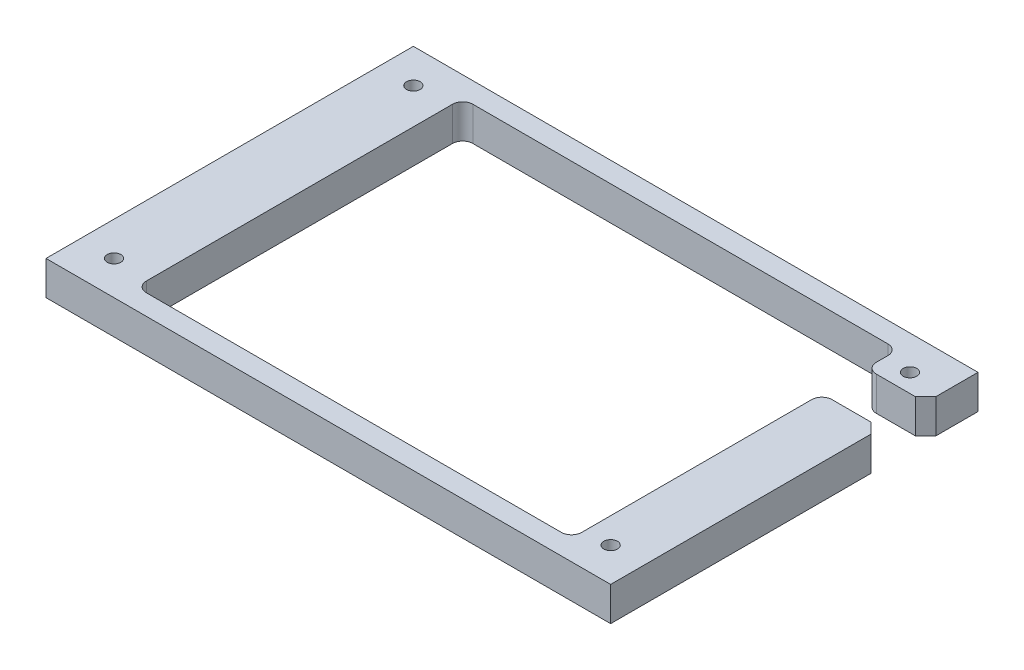
ISO-10303-21;
HEADER;
FILE_DESCRIPTION(('STEP AP214'),'2;1');
FILE_NAME('part.step','',(''),(''),'','','');
FILE_SCHEMA(('AUTOMOTIVE_DESIGN { 1 0 10303 214 1 1 1 1 }'));
ENDSEC;
DATA;
#1=APPLICATION_CONTEXT('core data for automotive mechanical design processes');
#2=APPLICATION_PROTOCOL_DEFINITION('international standard','automotive_design',2000,#1);
#3=PRODUCT_CONTEXT('',#1,'mechanical');
#4=PRODUCT('Part','Part','',(#3));
#5=PRODUCT_RELATED_PRODUCT_CATEGORY('part','',(#4));
#6=PRODUCT_DEFINITION_FORMATION('','',#4);
#7=PRODUCT_DEFINITION_CONTEXT('part definition',#1,'design');
#8=PRODUCT_DEFINITION('design','',#6,#7);
#9=PRODUCT_DEFINITION_SHAPE('','',#8);
#10=(LENGTH_UNIT() NAMED_UNIT(*) SI_UNIT(.MILLI.,.METRE.));
#11=(NAMED_UNIT(*) PLANE_ANGLE_UNIT() SI_UNIT($,.RADIAN.));
#12=(NAMED_UNIT(*) SI_UNIT($,.STERADIAN.) SOLID_ANGLE_UNIT());
#13=UNCERTAINTY_MEASURE_WITH_UNIT(LENGTH_MEASURE(1.E-05),#10,'distance_accuracy_value','');
#14=(GEOMETRIC_REPRESENTATION_CONTEXT(3) GLOBAL_UNCERTAINTY_ASSIGNED_CONTEXT((#13)) GLOBAL_UNIT_ASSIGNED_CONTEXT((#10,
#11,#12)) REPRESENTATION_CONTEXT('',''));
#15=CARTESIAN_POINT('',(0.,0.,0.));
#16=DIRECTION('',(0.,0.,1.));
#17=DIRECTION('',(1.,0.,0.));
#18=AXIS2_PLACEMENT_3D('',#15,#16,#17);
#19=CARTESIAN_POINT('',(83.,10.,54.));
#20=DIRECTION('',(-1.,0.,0.));
#21=DIRECTION('',(0.,0.,1.));
#22=AXIS2_PLACEMENT_3D('',#19,#20,#21);
#23=PLANE('',#22);
#24=DIRECTION('',(0.,0.,-1.));
#25=VECTOR('',#24,1.);
#26=CARTESIAN_POINT('',(83.,10.,54.));
#27=LINE('',#26,#25);
#28=CARTESIAN_POINT('',(83.,10.,-41.6));
#29=VERTEX_POINT('',#28);
#30=CARTESIAN_POINT('',(83.,10.,-54.));
#31=VERTEX_POINT('',#30);
#32=EDGE_CURVE('E170',#29,#31,#27,.T.);
#33=ORIENTED_EDGE('',*,*,#32,.F.);
#34=DIRECTION('',(0.,-1.,0.));
#35=VECTOR('',#34,1.);
#36=CARTESIAN_POINT('',(83.,10.,-41.6));
#37=LINE('',#36,#35);
#38=CARTESIAN_POINT('',(83.,0.,-41.6));
#39=VERTEX_POINT('',#38);
#40=EDGE_CURVE('E256',#29,#39,#37,.T.);
#41=ORIENTED_EDGE('',*,*,#40,.T.);
#42=DIRECTION('',(0.,0.,-1.));
#43=VECTOR('',#42,1.);
#44=CARTESIAN_POINT('',(83.,0.,54.));
#45=LINE('',#44,#43);
#46=CARTESIAN_POINT('',(83.,0.,-54.));
#47=VERTEX_POINT('',#46);
#48=EDGE_CURVE('E194',#39,#47,#45,.T.);
#49=ORIENTED_EDGE('',*,*,#48,.T.);
#50=DIRECTION('',(0.,-1.,0.));
#51=VECTOR('',#50,1.);
#52=CARTESIAN_POINT('',(83.,10.,-54.));
#53=LINE('',#52,#51);
#54=EDGE_CURVE('E187',#31,#47,#53,.T.);
#55=ORIENTED_EDGE('',*,*,#54,.F.);
#56=EDGE_LOOP('',(#33,#41,#49,#55));
#57=FACE_BOUND('',#56,.T.);
#58=ADVANCED_FACE('F34',(#57),#23,.F.);
#59=CARTESIAN_POINT('',(65.5,0.,48.));
#60=DIRECTION('',(1.,0.,0.));
#61=DIRECTION('',(0.,0.,-1.));
#62=AXIS2_PLACEMENT_3D('',#59,#60,#61);
#63=PLANE('',#62);
#64=DIRECTION('',(0.,0.,-1.));
#65=VECTOR('',#64,1.);
#66=CARTESIAN_POINT('',(65.5,0.,48.));
#67=LINE('',#66,#65);
#68=CARTESIAN_POINT('',(65.5,0.,-41.6));
#69=VERTEX_POINT('',#68);
#70=CARTESIAN_POINT('',(65.5,0.,-45.));
#71=VERTEX_POINT('',#70);
#72=EDGE_CURVE('E275',#69,#71,#67,.T.);
#73=ORIENTED_EDGE('',*,*,#72,.F.);
#74=DIRECTION('',(0.,1.,0.));
#75=VECTOR('',#74,1.);
#76=CARTESIAN_POINT('',(65.5,0.,-41.6));
#77=LINE('',#76,#75);
#78=CARTESIAN_POINT('',(65.5,10.,-41.6));
#79=VERTEX_POINT('',#78);
#80=EDGE_CURVE('E42',#69,#79,#77,.T.);
#81=ORIENTED_EDGE('',*,*,#80,.T.);
#82=DIRECTION('',(0.,0.,-1.));
#83=VECTOR('',#82,1.);
#84=CARTESIAN_POINT('',(65.5,10.,48.));
#85=LINE('',#84,#83);
#86=CARTESIAN_POINT('',(65.5,10.,-45.));
#87=VERTEX_POINT('',#86);
#88=EDGE_CURVE('E274',#79,#87,#85,.T.);
#89=ORIENTED_EDGE('',*,*,#88,.T.);
#90=DIRECTION('',(0.,1.,0.));
#91=VECTOR('',#90,1.);
#92=CARTESIAN_POINT('',(65.5,0.,-45.));
#93=LINE('',#92,#91);
#94=EDGE_CURVE('E206',#87,#71,#93,.F.);
#95=ORIENTED_EDGE('',*,*,#94,.T.);
#96=EDGE_LOOP('',(#73,#81,#89,#95));
#97=FACE_BOUND('',#96,.T.);
#98=ADVANCED_FACE('F273',(#97),#63,.F.);
#99=CARTESIAN_POINT('',(83.,0.,54.));
#100=VERTEX_POINT('',#99);
#101=CARTESIAN_POINT('',(83.,0.,-22.6));
#102=VERTEX_POINT('',#101);
#103=EDGE_CURVE('E327',#100,#102,#45,.T.);
#104=ORIENTED_EDGE('',*,*,#103,.T.);
#105=DIRECTION('',(0.,1.,0.));
#106=VECTOR('',#105,1.);
#107=CARTESIAN_POINT('',(83.,10.,-22.6));
#108=LINE('',#107,#106);
#109=CARTESIAN_POINT('',(83.,10.,-22.6));
#110=VERTEX_POINT('',#109);
#111=EDGE_CURVE('E239',#102,#110,#108,.T.);
#112=ORIENTED_EDGE('',*,*,#111,.T.);
#113=CARTESIAN_POINT('',(83.,10.,54.));
#114=VERTEX_POINT('',#113);
#115=EDGE_CURVE('E181',#114,#110,#27,.T.);
#116=ORIENTED_EDGE('',*,*,#115,.F.);
#117=DIRECTION('',(0.,-1.,0.));
#118=VECTOR('',#117,1.);
#119=CARTESIAN_POINT('',(83.,10.,54.));
#120=LINE('',#119,#118);
#121=EDGE_CURVE('E326',#114,#100,#120,.T.);
#122=ORIENTED_EDGE('',*,*,#121,.T.);
#123=EDGE_LOOP('',(#104,#112,#116,#122));
#124=FACE_BOUND('',#123,.T.);
#125=ADVANCED_FACE('F352',(#124),#23,.F.);
#126=CARTESIAN_POINT('',(-83.,10.,-54.));
#127=DIRECTION('',(0.,0.,1.));
#128=DIRECTION('',(1.,0.,0.));
#129=AXIS2_PLACEMENT_3D('',#126,#127,#128);
#130=PLANE('',#129);
#131=DIRECTION('',(-1.,0.,0.));
#132=VECTOR('',#131,1.);
#133=CARTESIAN_POINT('',(-83.,0.,-54.));
#134=LINE('',#133,#132);
#135=CARTESIAN_POINT('',(-83.,0.,-54.));
#136=VERTEX_POINT('',#135);
#137=EDGE_CURVE('E330',#47,#136,#134,.T.);
#138=ORIENTED_EDGE('',*,*,#137,.T.);
#139=DIRECTION('',(0.,-1.,0.));
#140=VECTOR('',#139,1.);
#141=CARTESIAN_POINT('',(-83.,10.,-54.));
#142=LINE('',#141,#140);
#143=CARTESIAN_POINT('',(-83.,10.,-54.));
#144=VERTEX_POINT('',#143);
#145=EDGE_CURVE('E189',#144,#136,#142,.T.);
#146=ORIENTED_EDGE('',*,*,#145,.F.);
#147=DIRECTION('',(-1.,0.,0.));
#148=VECTOR('',#147,1.);
#149=CARTESIAN_POINT('',(-83.,10.,-54.));
#150=LINE('',#149,#148);
#151=EDGE_CURVE('E174',#31,#144,#150,.T.);
#152=ORIENTED_EDGE('',*,*,#151,.F.);
#153=ORIENTED_EDGE('',*,*,#54,.T.);
#154=EDGE_LOOP('',(#138,#146,#152,#153));
#155=FACE_BOUND('',#154,.T.);
#156=ADVANCED_FACE('F186',(#155),#130,.F.);
#157=CARTESIAN_POINT('',(-83.,10.,54.));
#158=DIRECTION('',(1.,0.,0.));
#159=DIRECTION('',(0.,0.,-1.));
#160=AXIS2_PLACEMENT_3D('',#157,#158,#159);
#161=PLANE('',#160);
#162=DIRECTION('',(0.,0.,1.));
#163=VECTOR('',#162,1.);
#164=CARTESIAN_POINT('',(-83.,0.,54.));
#165=LINE('',#164,#163);
#166=CARTESIAN_POINT('',(-83.,0.,54.));
#167=VERTEX_POINT('',#166);
#168=EDGE_CURVE('E332',#136,#167,#165,.T.);
#169=ORIENTED_EDGE('',*,*,#168,.T.);
#170=DIRECTION('',(0.,-1.,0.));
#171=VECTOR('',#170,1.);
#172=CARTESIAN_POINT('',(-83.,10.,54.));
#173=LINE('',#172,#171);
#174=CARTESIAN_POINT('',(-83.,10.,54.));
#175=VERTEX_POINT('',#174);
#176=EDGE_CURVE('E200',#175,#167,#173,.T.);
#177=ORIENTED_EDGE('',*,*,#176,.F.);
#178=DIRECTION('',(0.,0.,1.));
#179=VECTOR('',#178,1.);
#180=CARTESIAN_POINT('',(-83.,10.,54.));
#181=LINE('',#180,#179);
#182=EDGE_CURVE('E191',#144,#175,#181,.T.);
#183=ORIENTED_EDGE('',*,*,#182,.F.);
#184=ORIENTED_EDGE('',*,*,#145,.T.);
#185=EDGE_LOOP('',(#169,#177,#183,#184));
#186=FACE_BOUND('',#185,.T.);
#187=ADVANCED_FACE('F358',(#186),#161,.F.);
#188=CARTESIAN_POINT('',(-83.,10.,54.));
#189=DIRECTION('',(0.,0.,-1.));
#190=DIRECTION('',(-1.,0.,0.));
#191=AXIS2_PLACEMENT_3D('',#188,#189,#190);
#192=PLANE('',#191);
#193=DIRECTION('',(1.,0.,0.));
#194=VECTOR('',#193,1.);
#195=CARTESIAN_POINT('',(-83.,0.,54.));
#196=LINE('',#195,#194);
#197=EDGE_CURVE('E182',#167,#100,#196,.T.);
#198=ORIENTED_EDGE('',*,*,#197,.T.);
#199=ORIENTED_EDGE('',*,*,#121,.F.);
#200=DIRECTION('',(1.,0.,0.));
#201=VECTOR('',#200,1.);
#202=CARTESIAN_POINT('',(-83.,10.,54.));
#203=LINE('',#202,#201);
#204=EDGE_CURVE('E324',#175,#114,#203,.T.);
#205=ORIENTED_EDGE('',*,*,#204,.F.);
#206=ORIENTED_EDGE('',*,*,#176,.T.);
#207=EDGE_LOOP('',(#198,#199,#205,#206));
#208=FACE_BOUND('',#207,.T.);
#209=ADVANCED_FACE('F341',(#208),#192,.F.);
#210=CARTESIAN_POINT('',(0.,10.,0.));
#211=DIRECTION('',(0.,-1.,0.));
#212=DIRECTION('',(0.,0.,-1.));
#213=AXIS2_PLACEMENT_3D('',#210,#211,#212);
#214=PLANE('',#213);
#215=CARTESIAN_POINT('',(73.,10.,44.));
#216=DIRECTION('',(0.,1.,0.));
#217=DIRECTION('',(0.,0.,1.));
#218=AXIS2_PLACEMENT_3D('',#215,#216,#217);
#219=CIRCLE('',#218,2.);
#220=CARTESIAN_POINT('',(73.,10.,46.));
#221=VERTEX_POINT('',#220);
#222=EDGE_CURVE('E302',#221,#221,#219,.T.);
#223=ORIENTED_EDGE('',*,*,#222,.F.);
#224=EDGE_LOOP('',(#223));
#225=FACE_BOUND('',#224,.T.);
#226=CARTESIAN_POINT('',(-73.,10.,44.));
#227=DIRECTION('',(0.,1.,0.));
#228=DIRECTION('',(0.,0.,1.));
#229=AXIS2_PLACEMENT_3D('',#226,#227,#228);
#230=CIRCLE('',#229,2.);
#231=CARTESIAN_POINT('',(-73.,10.,46.));
#232=VERTEX_POINT('',#231);
#233=EDGE_CURVE('E301',#232,#232,#230,.T.);
#234=ORIENTED_EDGE('',*,*,#233,.F.);
#235=EDGE_LOOP('',(#234));
#236=FACE_BOUND('',#235,.T.);
#237=CARTESIAN_POINT('',(73.,10.,-44.));
#238=DIRECTION('',(0.,1.,0.));
#239=DIRECTION('',(0.,0.,1.));
#240=AXIS2_PLACEMENT_3D('',#237,#238,#239);
#241=CIRCLE('',#240,2.);
#242=CARTESIAN_POINT('',(73.,10.,-42.));
#243=VERTEX_POINT('',#242);
#244=EDGE_CURVE('E308',#243,#243,#241,.T.);
#245=ORIENTED_EDGE('',*,*,#244,.F.);
#246=EDGE_LOOP('',(#245));
#247=FACE_BOUND('',#246,.T.);
#248=CARTESIAN_POINT('',(-73.,10.,-44.));
#249=DIRECTION('',(0.,1.,0.));
#250=DIRECTION('',(0.,0.,1.));
#251=AXIS2_PLACEMENT_3D('',#248,#249,#250);
#252=CIRCLE('',#251,2.);
#253=CARTESIAN_POINT('',(-73.,10.,-42.));
#254=VERTEX_POINT('',#253);
#255=EDGE_CURVE('E314',#254,#254,#252,.T.);
#256=ORIENTED_EDGE('',*,*,#255,.F.);
#257=EDGE_LOOP('',(#256));
#258=FACE_BOUND('',#257,.T.);
#259=DIRECTION('',(1.,0.,0.));
#260=VECTOR('',#259,1.);
#261=CARTESIAN_POINT('',(65.5,10.,-25.6));
#262=LINE('',#261,#260);
#263=CARTESIAN_POINT('',(68.5,10.,-25.6));
#264=VERTEX_POINT('',#263);
#265=CARTESIAN_POINT('',(80.,10.,-25.6));
#266=VERTEX_POINT('',#265);
#267=EDGE_CURVE('E357',#264,#266,#262,.T.);
#268=ORIENTED_EDGE('',*,*,#267,.F.);
#269=CARTESIAN_POINT('',(68.5,10.,-22.6));
#270=DIRECTION('',(0.,-1.,0.));
#271=DIRECTION('',(0.,0.,-1.));
#272=AXIS2_PLACEMENT_3D('',#269,#270,#271);
#273=CIRCLE('',#272,3.);
#274=CARTESIAN_POINT('',(65.5,10.,-22.6));
#275=VERTEX_POINT('',#274);
#276=EDGE_CURVE('E263',#264,#275,#273,.F.);
#277=ORIENTED_EDGE('',*,*,#276,.T.);
#278=CARTESIAN_POINT('',(65.5,10.,45.));
#279=VERTEX_POINT('',#278);
#280=EDGE_CURVE('E279',#279,#275,#85,.T.);
#281=ORIENTED_EDGE('',*,*,#280,.F.);
#282=CARTESIAN_POINT('',(62.5,10.,45.));
#283=DIRECTION('',(0.,-1.,0.));
#284=DIRECTION('',(0.,0.,-1.));
#285=AXIS2_PLACEMENT_3D('',#282,#283,#284);
#286=CIRCLE('',#285,3.);
#287=CARTESIAN_POINT('',(62.5,10.,48.));
#288=VERTEX_POINT('',#287);
#289=EDGE_CURVE('E227',#279,#288,#286,.T.);
#290=ORIENTED_EDGE('',*,*,#289,.T.);
#291=DIRECTION('',(1.,0.,0.));
#292=VECTOR('',#291,1.);
#293=CARTESIAN_POINT('',(-62.5,10.,48.));
#294=LINE('',#293,#292);
#295=CARTESIAN_POINT('',(-59.5,10.,48.));
#296=VERTEX_POINT('',#295);
#297=EDGE_CURVE('E295',#296,#288,#294,.T.);
#298=ORIENTED_EDGE('',*,*,#297,.F.);
#299=CARTESIAN_POINT('',(-59.5,10.,45.));
#300=DIRECTION('',(0.,-1.,0.));
#301=DIRECTION('',(0.,0.,-1.));
#302=AXIS2_PLACEMENT_3D('',#299,#300,#301);
#303=CIRCLE('',#302,3.);
#304=CARTESIAN_POINT('',(-62.5,10.,45.));
#305=VERTEX_POINT('',#304);
#306=EDGE_CURVE('E231',#296,#305,#303,.T.);
#307=ORIENTED_EDGE('',*,*,#306,.T.);
#308=DIRECTION('',(0.,0.,1.));
#309=VECTOR('',#308,1.);
#310=CARTESIAN_POINT('',(-62.5,10.,48.));
#311=LINE('',#310,#309);
#312=CARTESIAN_POINT('',(-62.5,10.,-45.));
#313=VERTEX_POINT('',#312);
#314=EDGE_CURVE('E292',#313,#305,#311,.T.);
#315=ORIENTED_EDGE('',*,*,#314,.F.);
#316=CARTESIAN_POINT('',(-59.5,10.,-45.));
#317=DIRECTION('',(0.,-1.,0.));
#318=DIRECTION('',(0.,0.,-1.));
#319=AXIS2_PLACEMENT_3D('',#316,#317,#318);
#320=CIRCLE('',#319,3.);
#321=CARTESIAN_POINT('',(-59.5,10.,-48.));
#322=VERTEX_POINT('',#321);
#323=EDGE_CURVE('E235',#313,#322,#320,.T.);
#324=ORIENTED_EDGE('',*,*,#323,.T.);
#325=DIRECTION('',(-1.,0.,0.));
#326=VECTOR('',#325,1.);
#327=CARTESIAN_POINT('',(-62.5,10.,-48.));
#328=LINE('',#327,#326);
#329=CARTESIAN_POINT('',(62.5,10.,-48.));
#330=VERTEX_POINT('',#329);
#331=EDGE_CURVE('E283',#330,#322,#328,.T.);
#332=ORIENTED_EDGE('',*,*,#331,.F.);
#333=CARTESIAN_POINT('',(62.5,10.,-45.));
#334=DIRECTION('',(0.,-1.,0.));
#335=DIRECTION('',(0.,0.,-1.));
#336=AXIS2_PLACEMENT_3D('',#333,#334,#335);
#337=CIRCLE('',#336,3.);
#338=EDGE_CURVE('E222',#330,#87,#337,.T.);
#339=ORIENTED_EDGE('',*,*,#338,.T.);
#340=ORIENTED_EDGE('',*,*,#88,.F.);
#341=CARTESIAN_POINT('',(68.5,10.,-41.6));
#342=DIRECTION('',(0.,-1.,0.));
#343=DIRECTION('',(0.,0.,-1.));
#344=AXIS2_PLACEMENT_3D('',#341,#342,#343);
#345=CIRCLE('',#344,3.);
#346=CARTESIAN_POINT('',(68.5,10.,-38.6));
#347=VERTEX_POINT('',#346);
#348=EDGE_CURVE('E261',#79,#347,#345,.F.);
#349=ORIENTED_EDGE('',*,*,#348,.T.);
#350=DIRECTION('',(-1.,0.,0.));
#351=VECTOR('',#350,1.);
#352=CARTESIAN_POINT('',(65.5,10.,-38.6));
#353=LINE('',#352,#351);
#354=CARTESIAN_POINT('',(80.,10.,-38.6));
#355=VERTEX_POINT('',#354);
#356=EDGE_CURVE('E600',#355,#347,#353,.T.);
#357=ORIENTED_EDGE('',*,*,#356,.F.);
#358=DIRECTION('',(-0.707106781186543,0.,0.707106781186552));
#359=VECTOR('',#358,1.);
#360=CARTESIAN_POINT('',(80.,10.,-38.6));
#361=LINE('',#360,#359);
#362=EDGE_CURVE('E177',#355,#29,#361,.F.);
#363=ORIENTED_EDGE('',*,*,#362,.T.);
#364=ORIENTED_EDGE('',*,*,#32,.T.);
#365=ORIENTED_EDGE('',*,*,#151,.T.);
#366=ORIENTED_EDGE('',*,*,#182,.T.);
#367=ORIENTED_EDGE('',*,*,#204,.T.);
#368=ORIENTED_EDGE('',*,*,#115,.T.);
#369=DIRECTION('',(0.707106781186551,0.,0.707106781186544));
#370=VECTOR('',#369,1.);
#371=CARTESIAN_POINT('',(83.,10.,-22.6));
#372=LINE('',#371,#370);
#373=EDGE_CURVE('E243',#110,#266,#372,.F.);
#374=ORIENTED_EDGE('',*,*,#373,.T.);
#375=EDGE_LOOP('',(#268,#277,#281,#290,#298,#307,#315,#324,#332,#339,#340,#349,#357,#363,#364,
#365,#366,#367,#368,#374));
#376=FACE_BOUND('',#375,.T.);
#377=ADVANCED_FACE('F173',(#225,#236,#247,#258,#376),#214,.F.);
#378=CARTESIAN_POINT('',(0.,0.,0.));
#379=DIRECTION('',(0.,-1.,0.));
#380=DIRECTION('',(0.,0.,-1.));
#381=AXIS2_PLACEMENT_3D('',#378,#379,#380);
#382=PLANE('',#381);
#383=CARTESIAN_POINT('',(65.5,0.,45.));
#384=VERTEX_POINT('',#383);
#385=CARTESIAN_POINT('',(65.5,0.,-22.6));
#386=VERTEX_POINT('',#385);
#387=EDGE_CURVE('E599',#384,#386,#67,.T.);
#388=ORIENTED_EDGE('',*,*,#387,.T.);
#389=CARTESIAN_POINT('',(68.5,0.,-22.6));
#390=DIRECTION('',(0.,-1.,0.));
#391=DIRECTION('',(0.,0.,-1.));
#392=AXIS2_PLACEMENT_3D('',#389,#390,#391);
#393=CIRCLE('',#392,3.);
#394=CARTESIAN_POINT('',(68.5,0.,-25.6));
#395=VERTEX_POINT('',#394);
#396=EDGE_CURVE('E268',#386,#395,#393,.T.);
#397=ORIENTED_EDGE('',*,*,#396,.T.);
#398=DIRECTION('',(1.,0.,0.));
#399=VECTOR('',#398,1.);
#400=CARTESIAN_POINT('',(65.5,0.,-25.6));
#401=LINE('',#400,#399);
#402=CARTESIAN_POINT('',(80.,0.,-25.6));
#403=VERTEX_POINT('',#402);
#404=EDGE_CURVE('E284',#395,#403,#401,.T.);
#405=ORIENTED_EDGE('',*,*,#404,.T.);
#406=DIRECTION('',(-0.707106781186551,0.,-0.707106781186544));
#407=VECTOR('',#406,1.);
#408=CARTESIAN_POINT('',(52.7999999999996,0.,-52.8000000000001));
#409=LINE('',#408,#407);
#410=EDGE_CURVE('E251',#403,#102,#409,.F.);
#411=ORIENTED_EDGE('',*,*,#410,.T.);
#412=ORIENTED_EDGE('',*,*,#103,.F.);
#413=ORIENTED_EDGE('',*,*,#197,.F.);
#414=ORIENTED_EDGE('',*,*,#168,.F.);
#415=ORIENTED_EDGE('',*,*,#137,.F.);
#416=ORIENTED_EDGE('',*,*,#48,.F.);
#417=DIRECTION('',(0.707106781186543,0.,-0.707106781186552));
#418=VECTOR('',#417,1.);
#419=CARTESIAN_POINT('',(20.7000000000005,0.,20.7000000000002));
#420=LINE('',#419,#418);
#421=CARTESIAN_POINT('',(80.,0.,-38.6));
#422=VERTEX_POINT('',#421);
#423=EDGE_CURVE('E249',#39,#422,#420,.F.);
#424=ORIENTED_EDGE('',*,*,#423,.T.);
#425=DIRECTION('',(-1.,0.,0.));
#426=VECTOR('',#425,1.);
#427=CARTESIAN_POINT('',(65.5,0.,-38.6));
#428=LINE('',#427,#426);
#429=CARTESIAN_POINT('',(68.5,0.,-38.6));
#430=VERTEX_POINT('',#429);
#431=EDGE_CURVE('E280',#422,#430,#428,.T.);
#432=ORIENTED_EDGE('',*,*,#431,.T.);
#433=CARTESIAN_POINT('',(68.5,0.,-41.6));
#434=DIRECTION('',(0.,-1.,0.));
#435=DIRECTION('',(0.,0.,-1.));
#436=AXIS2_PLACEMENT_3D('',#433,#434,#435);
#437=CIRCLE('',#436,3.);
#438=EDGE_CURVE('E49',#430,#69,#437,.T.);
#439=ORIENTED_EDGE('',*,*,#438,.T.);
#440=ORIENTED_EDGE('',*,*,#72,.T.);
#441=CARTESIAN_POINT('',(62.5,0.,-45.));
#442=DIRECTION('',(0.,-1.,0.));
#443=DIRECTION('',(0.,0.,-1.));
#444=AXIS2_PLACEMENT_3D('',#441,#442,#443);
#445=CIRCLE('',#444,3.);
#446=CARTESIAN_POINT('',(62.5,0.,-48.));
#447=VERTEX_POINT('',#446);
#448=EDGE_CURVE('E225',#71,#447,#445,.F.);
#449=ORIENTED_EDGE('',*,*,#448,.T.);
#450=DIRECTION('',(-1.,0.,0.));
#451=VECTOR('',#450,1.);
#452=CARTESIAN_POINT('',(-62.5,0.,-48.));
#453=LINE('',#452,#451);
#454=CARTESIAN_POINT('',(-59.5,0.,-48.));
#455=VERTEX_POINT('',#454);
#456=EDGE_CURVE('E606',#447,#455,#453,.T.);
#457=ORIENTED_EDGE('',*,*,#456,.T.);
#458=CARTESIAN_POINT('',(-59.5,0.,-45.));
#459=DIRECTION('',(0.,-1.,0.));
#460=DIRECTION('',(0.,0.,-1.));
#461=AXIS2_PLACEMENT_3D('',#458,#459,#460);
#462=CIRCLE('',#461,3.);
#463=CARTESIAN_POINT('',(-62.5,0.,-45.));
#464=VERTEX_POINT('',#463);
#465=EDGE_CURVE('E237',#455,#464,#462,.F.);
#466=ORIENTED_EDGE('',*,*,#465,.T.);
#467=DIRECTION('',(0.,0.,1.));
#468=VECTOR('',#467,1.);
#469=CARTESIAN_POINT('',(-62.5,0.,48.));
#470=LINE('',#469,#468);
#471=CARTESIAN_POINT('',(-62.5,0.,45.));
#472=VERTEX_POINT('',#471);
#473=EDGE_CURVE('E608',#464,#472,#470,.T.);
#474=ORIENTED_EDGE('',*,*,#473,.T.);
#475=CARTESIAN_POINT('',(-59.5,0.,45.));
#476=DIRECTION('',(0.,-1.,0.));
#477=DIRECTION('',(0.,0.,-1.));
#478=AXIS2_PLACEMENT_3D('',#475,#476,#477);
#479=CIRCLE('',#478,3.);
#480=CARTESIAN_POINT('',(-59.5,0.,48.));
#481=VERTEX_POINT('',#480);
#482=EDGE_CURVE('E233',#472,#481,#479,.F.);
#483=ORIENTED_EDGE('',*,*,#482,.T.);
#484=DIRECTION('',(1.,0.,0.));
#485=VECTOR('',#484,1.);
#486=CARTESIAN_POINT('',(-62.5,0.,48.));
#487=LINE('',#486,#485);
#488=CARTESIAN_POINT('',(62.5,0.,48.));
#489=VERTEX_POINT('',#488);
#490=EDGE_CURVE('E288',#481,#489,#487,.T.);
#491=ORIENTED_EDGE('',*,*,#490,.T.);
#492=CARTESIAN_POINT('',(62.5,0.,45.));
#493=DIRECTION('',(0.,-1.,0.));
#494=DIRECTION('',(0.,0.,-1.));
#495=AXIS2_PLACEMENT_3D('',#492,#493,#494);
#496=CIRCLE('',#495,3.);
#497=EDGE_CURVE('E229',#489,#384,#496,.F.);
#498=ORIENTED_EDGE('',*,*,#497,.T.);
#499=EDGE_LOOP('',(#388,#397,#405,#411,#412,#413,#414,#415,#416,#424,#432,#439,#440,#449,#457,
#466,#474,#483,#491,#498));
#500=FACE_BOUND('',#499,.T.);
#501=CARTESIAN_POINT('',(73.,0.,44.));
#502=DIRECTION('',(0.,1.,0.));
#503=DIRECTION('',(0.,0.,1.));
#504=AXIS2_PLACEMENT_3D('',#501,#502,#503);
#505=CIRCLE('',#504,2.);
#506=CARTESIAN_POINT('',(73.,0.,46.));
#507=VERTEX_POINT('',#506);
#508=EDGE_CURVE('E298',#507,#507,#505,.T.);
#509=ORIENTED_EDGE('',*,*,#508,.T.);
#510=EDGE_LOOP('',(#509));
#511=FACE_BOUND('',#510,.T.);
#512=CARTESIAN_POINT('',(-73.,0.,44.));
#513=DIRECTION('',(0.,1.,0.));
#514=DIRECTION('',(0.,0.,1.));
#515=AXIS2_PLACEMENT_3D('',#512,#513,#514);
#516=CIRCLE('',#515,2.);
#517=CARTESIAN_POINT('',(-73.,0.,46.));
#518=VERTEX_POINT('',#517);
#519=EDGE_CURVE('E305',#518,#518,#516,.T.);
#520=ORIENTED_EDGE('',*,*,#519,.T.);
#521=EDGE_LOOP('',(#520));
#522=FACE_BOUND('',#521,.T.);
#523=CARTESIAN_POINT('',(73.,0.,-44.));
#524=DIRECTION('',(0.,1.,0.));
#525=DIRECTION('',(0.,0.,1.));
#526=AXIS2_PLACEMENT_3D('',#523,#524,#525);
#527=CIRCLE('',#526,2.);
#528=CARTESIAN_POINT('',(73.,0.,-42.));
#529=VERTEX_POINT('',#528);
#530=EDGE_CURVE('E311',#529,#529,#527,.T.);
#531=ORIENTED_EDGE('',*,*,#530,.T.);
#532=EDGE_LOOP('',(#531));
#533=FACE_BOUND('',#532,.T.);
#534=CARTESIAN_POINT('',(-73.,0.,-44.));
#535=DIRECTION('',(0.,1.,0.));
#536=DIRECTION('',(0.,0.,1.));
#537=AXIS2_PLACEMENT_3D('',#534,#535,#536);
#538=CIRCLE('',#537,2.);
#539=CARTESIAN_POINT('',(-73.,0.,-42.));
#540=VERTEX_POINT('',#539);
#541=EDGE_CURVE('E317',#540,#540,#538,.T.);
#542=ORIENTED_EDGE('',*,*,#541,.T.);
#543=EDGE_LOOP('',(#542));
#544=FACE_BOUND('',#543,.T.);
#545=ADVANCED_FACE('F347',(#500,#511,#522,#533,#544),#382,.T.);
#546=CARTESIAN_POINT('',(-73.,0.,-44.));
#547=DIRECTION('',(0.,1.,0.));
#548=DIRECTION('',(0.,0.,1.));
#549=AXIS2_PLACEMENT_3D('',#546,#547,#548);
#550=CYLINDRICAL_SURFACE('',#549,2.);
#551=ORIENTED_EDGE('',*,*,#541,.F.);
#552=EDGE_LOOP('',(#551));
#553=FACE_BOUND('',#552,.T.);
#554=ORIENTED_EDGE('',*,*,#255,.T.);
#555=EDGE_LOOP('',(#554));
#556=FACE_BOUND('',#555,.T.);
#557=ADVANCED_FACE('F402',(#553,#556),#550,.F.);
#558=CARTESIAN_POINT('',(73.,0.,-44.));
#559=DIRECTION('',(0.,1.,0.));
#560=DIRECTION('',(0.,0.,1.));
#561=AXIS2_PLACEMENT_3D('',#558,#559,#560);
#562=CYLINDRICAL_SURFACE('',#561,2.);
#563=ORIENTED_EDGE('',*,*,#530,.F.);
#564=EDGE_LOOP('',(#563));
#565=FACE_BOUND('',#564,.T.);
#566=ORIENTED_EDGE('',*,*,#244,.T.);
#567=EDGE_LOOP('',(#566));
#568=FACE_BOUND('',#567,.T.);
#569=ADVANCED_FACE('F407',(#565,#568),#562,.F.);
#570=CARTESIAN_POINT('',(-73.,0.,44.));
#571=DIRECTION('',(0.,1.,0.));
#572=DIRECTION('',(0.,0.,1.));
#573=AXIS2_PLACEMENT_3D('',#570,#571,#572);
#574=CYLINDRICAL_SURFACE('',#573,2.);
#575=ORIENTED_EDGE('',*,*,#519,.F.);
#576=EDGE_LOOP('',(#575));
#577=FACE_BOUND('',#576,.T.);
#578=ORIENTED_EDGE('',*,*,#233,.T.);
#579=EDGE_LOOP('',(#578));
#580=FACE_BOUND('',#579,.T.);
#581=ADVANCED_FACE('F419',(#577,#580),#574,.F.);
#582=CARTESIAN_POINT('',(73.,0.,44.));
#583=DIRECTION('',(0.,1.,0.));
#584=DIRECTION('',(0.,0.,1.));
#585=AXIS2_PLACEMENT_3D('',#582,#583,#584);
#586=CYLINDRICAL_SURFACE('',#585,2.);
#587=ORIENTED_EDGE('',*,*,#508,.F.);
#588=EDGE_LOOP('',(#587));
#589=FACE_BOUND('',#588,.T.);
#590=ORIENTED_EDGE('',*,*,#222,.T.);
#591=EDGE_LOOP('',(#590));
#592=FACE_BOUND('',#591,.T.);
#593=ADVANCED_FACE('F429',(#589,#592),#586,.F.);
#594=ORIENTED_EDGE('',*,*,#280,.T.);
#595=DIRECTION('',(0.,1.,0.));
#596=VECTOR('',#595,1.);
#597=CARTESIAN_POINT('',(65.5,0.,-22.6));
#598=LINE('',#597,#596);
#599=EDGE_CURVE('E265',#275,#386,#598,.F.);
#600=ORIENTED_EDGE('',*,*,#599,.T.);
#601=ORIENTED_EDGE('',*,*,#387,.F.);
#602=DIRECTION('',(0.,1.,0.));
#603=VECTOR('',#602,1.);
#604=CARTESIAN_POINT('',(65.5,10.,45.));
#605=LINE('',#604,#603);
#606=EDGE_CURVE('E209',#384,#279,#605,.T.);
#607=ORIENTED_EDGE('',*,*,#606,.T.);
#608=EDGE_LOOP('',(#594,#600,#601,#607));
#609=FACE_BOUND('',#608,.T.);
#610=ADVANCED_FACE('F373',(#609),#63,.F.);
#611=CARTESIAN_POINT('',(-62.5,0.,48.));
#612=DIRECTION('',(0.,0.,1.));
#613=DIRECTION('',(1.,0.,0.));
#614=AXIS2_PLACEMENT_3D('',#611,#612,#613);
#615=PLANE('',#614);
#616=ORIENTED_EDGE('',*,*,#297,.T.);
#617=DIRECTION('',(0.,1.,0.));
#618=VECTOR('',#617,1.);
#619=CARTESIAN_POINT('',(62.5,0.,48.));
#620=LINE('',#619,#618);
#621=EDGE_CURVE('E215',#288,#489,#620,.F.);
#622=ORIENTED_EDGE('',*,*,#621,.T.);
#623=ORIENTED_EDGE('',*,*,#490,.F.);
#624=DIRECTION('',(0.,1.,0.));
#625=VECTOR('',#624,1.);
#626=CARTESIAN_POINT('',(-59.5,10.,48.));
#627=LINE('',#626,#625);
#628=EDGE_CURVE('E212',#481,#296,#627,.T.);
#629=ORIENTED_EDGE('',*,*,#628,.T.);
#630=EDGE_LOOP('',(#616,#622,#623,#629));
#631=FACE_BOUND('',#630,.T.);
#632=ADVANCED_FACE('F446',(#631),#615,.F.);
#633=CARTESIAN_POINT('',(-62.5,0.,48.));
#634=DIRECTION('',(-1.,0.,0.));
#635=DIRECTION('',(0.,0.,1.));
#636=AXIS2_PLACEMENT_3D('',#633,#634,#635);
#637=PLANE('',#636);
#638=ORIENTED_EDGE('',*,*,#314,.T.);
#639=DIRECTION('',(0.,1.,0.));
#640=VECTOR('',#639,1.);
#641=CARTESIAN_POINT('',(-62.5,0.,45.));
#642=LINE('',#641,#640);
#643=EDGE_CURVE('E220',#305,#472,#642,.F.);
#644=ORIENTED_EDGE('',*,*,#643,.T.);
#645=ORIENTED_EDGE('',*,*,#473,.F.);
#646=DIRECTION('',(0.,1.,0.));
#647=VECTOR('',#646,1.);
#648=CARTESIAN_POINT('',(-62.5,10.,-45.));
#649=LINE('',#648,#647);
#650=EDGE_CURVE('E217',#464,#313,#649,.T.);
#651=ORIENTED_EDGE('',*,*,#650,.T.);
#652=EDGE_LOOP('',(#638,#644,#645,#651));
#653=FACE_BOUND('',#652,.T.);
#654=ADVANCED_FACE('F451',(#653),#637,.F.);
#655=CARTESIAN_POINT('',(-62.5,0.,-48.));
#656=DIRECTION('',(0.,0.,-1.));
#657=DIRECTION('',(-1.,0.,0.));
#658=AXIS2_PLACEMENT_3D('',#655,#656,#657);
#659=PLANE('',#658);
#660=ORIENTED_EDGE('',*,*,#456,.F.);
#661=DIRECTION('',(0.,1.,0.));
#662=VECTOR('',#661,1.);
#663=CARTESIAN_POINT('',(62.5,10.,-48.));
#664=LINE('',#663,#662);
#665=EDGE_CURVE('E198',#447,#330,#664,.T.);
#666=ORIENTED_EDGE('',*,*,#665,.T.);
#667=ORIENTED_EDGE('',*,*,#331,.T.);
#668=DIRECTION('',(0.,1.,0.));
#669=VECTOR('',#668,1.);
#670=CARTESIAN_POINT('',(-59.5,0.,-48.));
#671=LINE('',#670,#669);
#672=EDGE_CURVE('E196',#322,#455,#671,.F.);
#673=ORIENTED_EDGE('',*,*,#672,.T.);
#674=EDGE_LOOP('',(#660,#666,#667,#673));
#675=FACE_BOUND('',#674,.T.);
#676=ADVANCED_FACE('F461',(#675),#659,.F.);
#677=CARTESIAN_POINT('',(65.5,0.,-25.6));
#678=DIRECTION('',(0.,0.,1.));
#679=DIRECTION('',(1.,0.,0.));
#680=AXIS2_PLACEMENT_3D('',#677,#678,#679);
#681=PLANE('',#680);
#682=ORIENTED_EDGE('',*,*,#404,.F.);
#683=DIRECTION('',(0.,1.,0.));
#684=VECTOR('',#683,1.);
#685=CARTESIAN_POINT('',(68.5,0.,-25.6));
#686=LINE('',#685,#684);
#687=EDGE_CURVE('E258',#395,#264,#686,.T.);
#688=ORIENTED_EDGE('',*,*,#687,.T.);
#689=ORIENTED_EDGE('',*,*,#267,.T.);
#690=DIRECTION('',(0.,-1.,0.));
#691=VECTOR('',#690,1.);
#692=CARTESIAN_POINT('',(80.,0.,-25.6));
#693=LINE('',#692,#691);
#694=EDGE_CURVE('E246',#266,#403,#693,.T.);
#695=ORIENTED_EDGE('',*,*,#694,.T.);
#696=EDGE_LOOP('',(#682,#688,#689,#695));
#697=FACE_BOUND('',#696,.T.);
#698=ADVANCED_FACE('F471',(#697),#681,.F.);
#699=CARTESIAN_POINT('',(65.5,0.,-38.6));
#700=DIRECTION('',(0.,0.,-1.));
#701=DIRECTION('',(-1.,0.,0.));
#702=AXIS2_PLACEMENT_3D('',#699,#700,#701);
#703=PLANE('',#702);
#704=ORIENTED_EDGE('',*,*,#356,.T.);
#705=DIRECTION('',(0.,1.,0.));
#706=VECTOR('',#705,1.);
#707=CARTESIAN_POINT('',(68.5,0.,-38.6));
#708=LINE('',#707,#706);
#709=EDGE_CURVE('E11',#347,#430,#708,.F.);
#710=ORIENTED_EDGE('',*,*,#709,.T.);
#711=ORIENTED_EDGE('',*,*,#431,.F.);
#712=DIRECTION('',(0.,1.,0.));
#713=VECTOR('',#712,1.);
#714=CARTESIAN_POINT('',(80.,0.,-38.6));
#715=LINE('',#714,#713);
#716=EDGE_CURVE('E253',#422,#355,#715,.T.);
#717=ORIENTED_EDGE('',*,*,#716,.T.);
#718=EDGE_LOOP('',(#704,#710,#711,#717));
#719=FACE_BOUND('',#718,.T.);
#720=ADVANCED_FACE('F485',(#719),#703,.F.);
#721=CARTESIAN_POINT('',(62.5,0.,-45.));
#722=DIRECTION('',(0.,-1.,0.));
#723=DIRECTION('',(0.,0.,-1.));
#724=AXIS2_PLACEMENT_3D('',#721,#722,#723);
#725=CYLINDRICAL_SURFACE('',#724,3.);
#726=ORIENTED_EDGE('',*,*,#448,.F.);
#727=ORIENTED_EDGE('',*,*,#94,.F.);
#728=ORIENTED_EDGE('',*,*,#338,.F.);
#729=ORIENTED_EDGE('',*,*,#665,.F.);
#730=EDGE_LOOP('',(#726,#727,#728,#729));
#731=FACE_BOUND('',#730,.T.);
#732=ADVANCED_FACE('F479',(#731),#725,.F.);
#733=CARTESIAN_POINT('',(62.5,0.,45.));
#734=DIRECTION('',(0.,-1.,0.));
#735=DIRECTION('',(0.,0.,-1.));
#736=AXIS2_PLACEMENT_3D('',#733,#734,#735);
#737=CYLINDRICAL_SURFACE('',#736,3.);
#738=ORIENTED_EDGE('',*,*,#497,.F.);
#739=ORIENTED_EDGE('',*,*,#621,.F.);
#740=ORIENTED_EDGE('',*,*,#289,.F.);
#741=ORIENTED_EDGE('',*,*,#606,.F.);
#742=EDGE_LOOP('',(#738,#739,#740,#741));
#743=FACE_BOUND('',#742,.T.);
#744=ADVANCED_FACE('F484',(#743),#737,.F.);
#745=CARTESIAN_POINT('',(-59.5,0.,45.));
#746=DIRECTION('',(0.,-1.,0.));
#747=DIRECTION('',(0.,0.,-1.));
#748=AXIS2_PLACEMENT_3D('',#745,#746,#747);
#749=CYLINDRICAL_SURFACE('',#748,3.);
#750=ORIENTED_EDGE('',*,*,#482,.F.);
#751=ORIENTED_EDGE('',*,*,#643,.F.);
#752=ORIENTED_EDGE('',*,*,#306,.F.);
#753=ORIENTED_EDGE('',*,*,#628,.F.);
#754=EDGE_LOOP('',(#750,#751,#752,#753));
#755=FACE_BOUND('',#754,.T.);
#756=ADVANCED_FACE('F496',(#755),#749,.F.);
#757=CARTESIAN_POINT('',(-59.5,0.,-45.));
#758=DIRECTION('',(0.,-1.,0.));
#759=DIRECTION('',(0.,0.,-1.));
#760=AXIS2_PLACEMENT_3D('',#757,#758,#759);
#761=CYLINDRICAL_SURFACE('',#760,3.);
#762=ORIENTED_EDGE('',*,*,#465,.F.);
#763=ORIENTED_EDGE('',*,*,#672,.F.);
#764=ORIENTED_EDGE('',*,*,#323,.F.);
#765=ORIENTED_EDGE('',*,*,#650,.F.);
#766=EDGE_LOOP('',(#762,#763,#764,#765));
#767=FACE_BOUND('',#766,.T.);
#768=ADVANCED_FACE('F506',(#767),#761,.F.);
#769=CARTESIAN_POINT('',(83.,10.,-22.6));
#770=DIRECTION('',(-0.707106781186544,0.,0.707106781186551));
#771=DIRECTION('',(0.,1.,0.));
#772=AXIS2_PLACEMENT_3D('',#769,#770,#771);
#773=PLANE('',#772);
#774=ORIENTED_EDGE('',*,*,#410,.F.);
#775=ORIENTED_EDGE('',*,*,#694,.F.);
#776=ORIENTED_EDGE('',*,*,#373,.F.);
#777=ORIENTED_EDGE('',*,*,#111,.F.);
#778=EDGE_LOOP('',(#774,#775,#776,#777));
#779=FACE_BOUND('',#778,.T.);
#780=ADVANCED_FACE('F355',(#779),#773,.F.);
#781=CARTESIAN_POINT('',(80.,0.,-38.6));
#782=DIRECTION('',(-0.707106781186552,0.,-0.707106781186543));
#783=DIRECTION('',(0.,1.,0.));
#784=AXIS2_PLACEMENT_3D('',#781,#782,#783);
#785=PLANE('',#784);
#786=ORIENTED_EDGE('',*,*,#423,.F.);
#787=ORIENTED_EDGE('',*,*,#40,.F.);
#788=ORIENTED_EDGE('',*,*,#362,.F.);
#789=ORIENTED_EDGE('',*,*,#716,.F.);
#790=EDGE_LOOP('',(#786,#787,#788,#789));
#791=FACE_BOUND('',#790,.T.);
#792=ADVANCED_FACE('F548',(#791),#785,.F.);
#793=CARTESIAN_POINT('',(68.5,0.,-22.6));
#794=DIRECTION('',(0.,1.,0.));
#795=DIRECTION('',(0.,0.,1.));
#796=AXIS2_PLACEMENT_3D('',#793,#794,#795);
#797=CYLINDRICAL_SURFACE('',#796,3.);
#798=ORIENTED_EDGE('',*,*,#396,.F.);
#799=ORIENTED_EDGE('',*,*,#599,.F.);
#800=ORIENTED_EDGE('',*,*,#276,.F.);
#801=ORIENTED_EDGE('',*,*,#687,.F.);
#802=EDGE_LOOP('',(#798,#799,#800,#801));
#803=FACE_BOUND('',#802,.T.);
#804=ADVANCED_FACE('F543',(#803),#797,.T.);
#805=CARTESIAN_POINT('',(68.5,0.,-41.6));
#806=DIRECTION('',(0.,1.,0.));
#807=DIRECTION('',(0.,0.,1.));
#808=AXIS2_PLACEMENT_3D('',#805,#806,#807);
#809=CYLINDRICAL_SURFACE('',#808,3.);
#810=ORIENTED_EDGE('',*,*,#438,.F.);
#811=ORIENTED_EDGE('',*,*,#709,.F.);
#812=ORIENTED_EDGE('',*,*,#348,.F.);
#813=ORIENTED_EDGE('',*,*,#80,.F.);
#814=EDGE_LOOP('',(#810,#811,#812,#813));
#815=FACE_BOUND('',#814,.T.);
#816=ADVANCED_FACE('F36',(#815),#809,.T.);
#817=CLOSED_SHELL('',(#58,#98,#125,#156,#187,#209,#377,#545,#557,#569,#581,#593,#610,#632,#654,
#676,#698,#720,#732,#744,#756,#768,#780,#792,#804,#816));
#818=MANIFOLD_SOLID_BREP('B2',#817);
#819=ADVANCED_BREP_SHAPE_REPRESENTATION('',(#18,#818),#14);
#820=SHAPE_DEFINITION_REPRESENTATION(#9,#819);
ENDSEC;
END-ISO-10303-21;
